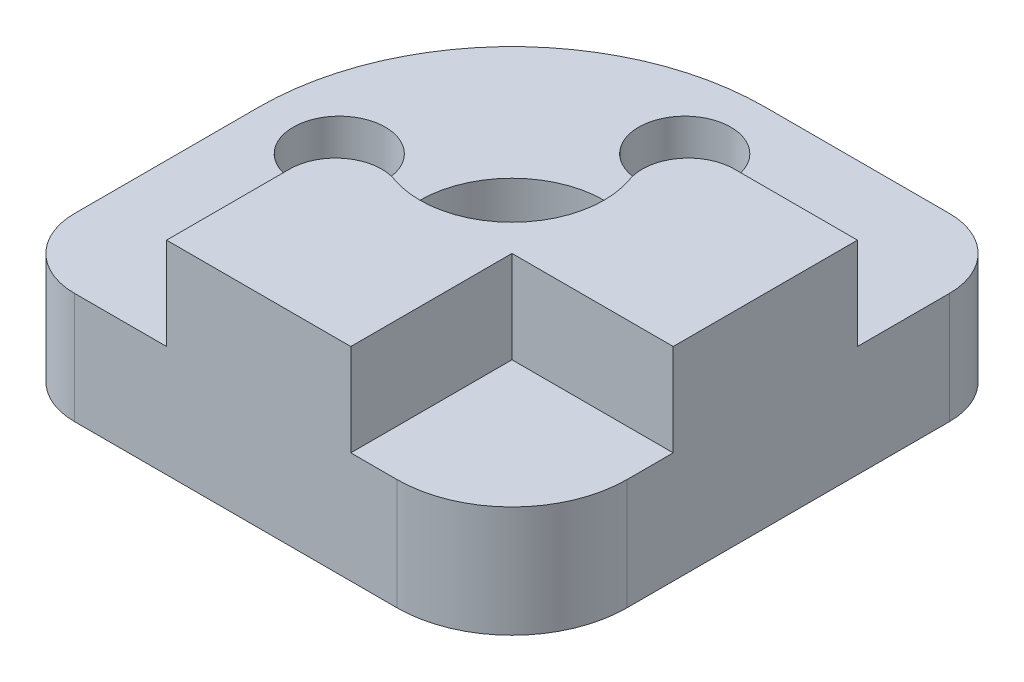
ISO-10303-21;
HEADER;
FILE_DESCRIPTION(('STEP AP214'),'2;1');
FILE_NAME('part.step','',(''),(''),'','','');
FILE_SCHEMA(('AUTOMOTIVE_DESIGN { 1 0 10303 214 1 1 1 1 }'));
ENDSEC;
DATA;
#1=APPLICATION_CONTEXT('core data for automotive mechanical design processes');
#2=APPLICATION_PROTOCOL_DEFINITION('international standard','automotive_design',2000,#1);
#3=PRODUCT_CONTEXT('',#1,'mechanical');
#4=PRODUCT('Part','Part','',(#3));
#5=PRODUCT_RELATED_PRODUCT_CATEGORY('part','',(#4));
#6=PRODUCT_DEFINITION_FORMATION('','',#4);
#7=PRODUCT_DEFINITION_CONTEXT('part definition',#1,'design');
#8=PRODUCT_DEFINITION('design','',#6,#7);
#9=PRODUCT_DEFINITION_SHAPE('','',#8);
#10=(LENGTH_UNIT() NAMED_UNIT(*) SI_UNIT(.MILLI.,.METRE.));
#11=(NAMED_UNIT(*) PLANE_ANGLE_UNIT() SI_UNIT($,.RADIAN.));
#12=(NAMED_UNIT(*) SI_UNIT($,.STERADIAN.) SOLID_ANGLE_UNIT());
#13=UNCERTAINTY_MEASURE_WITH_UNIT(LENGTH_MEASURE(1.E-05),#10,'distance_accuracy_value','');
#14=(GEOMETRIC_REPRESENTATION_CONTEXT(3) GLOBAL_UNCERTAINTY_ASSIGNED_CONTEXT((#13)) GLOBAL_UNIT_ASSIGNED_CONTEXT((#10,
#11,#12)) REPRESENTATION_CONTEXT('',''));
#15=CARTESIAN_POINT('',(0.,0.,0.));
#16=DIRECTION('',(0.,0.,1.));
#17=DIRECTION('',(1.,0.,0.));
#18=AXIS2_PLACEMENT_3D('',#15,#16,#17);
#19=CARTESIAN_POINT('',(0.,4.825,0.));
#20=DIRECTION('',(0.,1.,0.));
#21=DIRECTION('',(0.,0.,1.));
#22=AXIS2_PLACEMENT_3D('',#19,#20,#21);
#23=PLANE('',#22);
#24=DIRECTION('',(0.,0.,1.));
#25=VECTOR('',#24,1.);
#26=CARTESIAN_POINT('',(-4.,4.825,5.65685424949238));
#27=LINE('',#26,#25);
#28=CARTESIAN_POINT('',(-4.,4.825,5.65685424949238));
#29=VERTEX_POINT('',#28);
#30=CARTESIAN_POINT('',(-4.,4.825,11.));
#31=VERTEX_POINT('',#30);
#32=EDGE_CURVE('E50',#29,#31,#27,.T.);
#33=ORIENTED_EDGE('',*,*,#32,.F.);
#34=CARTESIAN_POINT('',(-2.,4.825,5.65685424949238));
#35=DIRECTION('',(0.,1.,0.));
#36=DIRECTION('',(0.,0.,1.));
#37=AXIS2_PLACEMENT_3D('',#34,#35,#36);
#38=CIRCLE('',#37,2.);
#39=CARTESIAN_POINT('',(-1.33333333333333,4.825,3.77123616632825));
#40=VERTEX_POINT('',#39);
#41=EDGE_CURVE('E193',#40,#29,#38,.T.);
#42=ORIENTED_EDGE('',*,*,#41,.F.);
#43=CARTESIAN_POINT('',(0.,4.825,0.));
#44=DIRECTION('',(0.,1.,0.));
#45=DIRECTION('',(0.,0.,1.));
#46=AXIS2_PLACEMENT_3D('',#43,#44,#45);
#47=CIRCLE('',#46,4.);
#48=CARTESIAN_POINT('',(3.77123616632825,4.825,-1.33333333333333));
#49=VERTEX_POINT('',#48);
#50=EDGE_CURVE('E221',#49,#40,#47,.T.);
#51=ORIENTED_EDGE('',*,*,#50,.F.);
#52=CARTESIAN_POINT('',(5.65685424949238,4.825,-2.));
#53=DIRECTION('',(0.,1.,0.));
#54=DIRECTION('',(0.,0.,-1.));
#55=AXIS2_PLACEMENT_3D('',#52,#53,#54);
#56=CIRCLE('',#55,2.);
#57=CARTESIAN_POINT('',(5.65685424949238,4.825,-4.));
#58=VERTEX_POINT('',#57);
#59=EDGE_CURVE('E57',#58,#49,#56,.T.);
#60=ORIENTED_EDGE('',*,*,#59,.F.);
#61=DIRECTION('',(-1.,0.,0.));
#62=VECTOR('',#61,1.);
#63=CARTESIAN_POINT('',(5.65685424949238,4.825,-4.));
#64=LINE('',#63,#62);
#65=CARTESIAN_POINT('',(11.,4.825,-4.));
#66=VERTEX_POINT('',#65);
#67=EDGE_CURVE('E310',#66,#58,#64,.T.);
#68=ORIENTED_EDGE('',*,*,#67,.F.);
#69=DIRECTION('',(0.,0.,-1.));
#70=VECTOR('',#69,1.);
#71=CARTESIAN_POINT('',(11.,4.825,6.));
#72=LINE('',#71,#70);
#73=CARTESIAN_POINT('',(11.,4.825,-7.99999999999998));
#74=VERTEX_POINT('',#73);
#75=EDGE_CURVE('E283',#66,#74,#72,.T.);
#76=ORIENTED_EDGE('',*,*,#75,.T.);
#77=CARTESIAN_POINT('',(8.,4.825,-8.));
#78=DIRECTION('',(0.,1.,0.));
#79=DIRECTION('',(0.,0.,1.));
#80=AXIS2_PLACEMENT_3D('',#77,#78,#79);
#81=CIRCLE('',#80,3.);
#82=CARTESIAN_POINT('',(7.99999999999998,4.825,-11.));
#83=VERTEX_POINT('',#82);
#84=EDGE_CURVE('E278',#74,#83,#81,.T.);
#85=ORIENTED_EDGE('',*,*,#84,.T.);
#86=DIRECTION('',(-1.,0.,0.));
#87=VECTOR('',#86,1.);
#88=CARTESIAN_POINT('',(0.,4.825,-11.));
#89=LINE('',#88,#87);
#90=CARTESIAN_POINT('',(0.,4.825,-11.));
#91=VERTEX_POINT('',#90);
#92=EDGE_CURVE('E260',#83,#91,#89,.T.);
#93=ORIENTED_EDGE('',*,*,#92,.T.);
#94=CARTESIAN_POINT('',(0.,4.825,0.));
#95=DIRECTION('',(0.,1.,0.));
#96=DIRECTION('',(0.,0.,1.));
#97=AXIS2_PLACEMENT_3D('',#94,#95,#96);
#98=CIRCLE('',#97,11.);
#99=CARTESIAN_POINT('',(-11.,4.825,0.));
#100=VERTEX_POINT('',#99);
#101=EDGE_CURVE('E222',#91,#100,#98,.T.);
#102=ORIENTED_EDGE('',*,*,#101,.T.);
#103=DIRECTION('',(0.,0.,1.));
#104=VECTOR('',#103,1.);
#105=CARTESIAN_POINT('',(-11.,4.825,0.));
#106=LINE('',#105,#104);
#107=CARTESIAN_POINT('',(-11.,4.825,7.99999999999998));
#108=VERTEX_POINT('',#107);
#109=EDGE_CURVE('E225',#100,#108,#106,.T.);
#110=ORIENTED_EDGE('',*,*,#109,.T.);
#111=CARTESIAN_POINT('',(-8.,4.825,8.));
#112=DIRECTION('',(0.,1.,0.));
#113=DIRECTION('',(0.,0.,-1.));
#114=AXIS2_PLACEMENT_3D('',#111,#112,#113);
#115=CIRCLE('',#114,3.);
#116=CARTESIAN_POINT('',(-7.99999999999998,4.825,11.));
#117=VERTEX_POINT('',#116);
#118=EDGE_CURVE('E228',#108,#117,#115,.T.);
#119=ORIENTED_EDGE('',*,*,#118,.T.);
#120=DIRECTION('',(1.,0.,0.));
#121=VECTOR('',#120,1.);
#122=CARTESIAN_POINT('',(6.,4.825,11.));
#123=LINE('',#122,#121);
#124=EDGE_CURVE('E238',#117,#31,#123,.T.);
#125=ORIENTED_EDGE('',*,*,#124,.T.);
#126=EDGE_LOOP('',(#33,#42,#51,#60,#68,#76,#85,#93,#102,#110,#119,#125));
#127=FACE_BOUND('',#126,.T.);
#128=CARTESIAN_POINT('',(0.,4.825,-7.5));
#129=DIRECTION('',(0.,1.,0.));
#130=DIRECTION('',(0.,0.,1.));
#131=AXIS2_PLACEMENT_3D('',#128,#129,#130);
#132=CIRCLE('',#131,2.);
#133=CARTESIAN_POINT('',(0.,4.825,-5.5));
#134=VERTEX_POINT('',#133);
#135=EDGE_CURVE('E181',#134,#134,#132,.T.);
#136=ORIENTED_EDGE('',*,*,#135,.F.);
#137=EDGE_LOOP('',(#136));
#138=FACE_BOUND('',#137,.T.);
#139=CARTESIAN_POINT('',(-7.5,4.825,0.));
#140=DIRECTION('',(0.,1.,0.));
#141=DIRECTION('',(0.,0.,1.));
#142=AXIS2_PLACEMENT_3D('',#139,#140,#141);
#143=CIRCLE('',#142,2.);
#144=CARTESIAN_POINT('',(-7.5,4.825,2.));
#145=VERTEX_POINT('',#144);
#146=EDGE_CURVE('E213',#145,#145,#143,.T.);
#147=ORIENTED_EDGE('',*,*,#146,.F.);
#148=EDGE_LOOP('',(#147));
#149=FACE_BOUND('',#148,.T.);
#150=ADVANCED_FACE('F33',(#127,#138,#149),#23,.T.);
#151=DIRECTION('',(1.,0.,0.));
#152=VECTOR('',#151,1.);
#153=CARTESIAN_POINT('',(4.,4.825,4.));
#154=LINE('',#153,#152);
#155=CARTESIAN_POINT('',(4.,4.825,4.));
#156=VERTEX_POINT('',#155);
#157=CARTESIAN_POINT('',(11.,4.825,4.));
#158=VERTEX_POINT('',#157);
#159=EDGE_CURVE('E308',#156,#158,#154,.T.);
#160=ORIENTED_EDGE('',*,*,#159,.F.);
#161=DIRECTION('',(0.,0.,-1.));
#162=VECTOR('',#161,1.);
#163=CARTESIAN_POINT('',(4.,4.825,11.));
#164=LINE('',#163,#162);
#165=CARTESIAN_POINT('',(4.,4.825,11.));
#166=VERTEX_POINT('',#165);
#167=EDGE_CURVE('E311',#166,#156,#164,.T.);
#168=ORIENTED_EDGE('',*,*,#167,.F.);
#169=CARTESIAN_POINT('',(6.,4.825,11.));
#170=VERTEX_POINT('',#169);
#171=EDGE_CURVE('E177',#166,#170,#123,.T.);
#172=ORIENTED_EDGE('',*,*,#171,.T.);
#173=CARTESIAN_POINT('',(6.,4.825,6.));
#174=DIRECTION('',(0.,1.,0.));
#175=DIRECTION('',(0.,0.,-1.));
#176=AXIS2_PLACEMENT_3D('',#173,#174,#175);
#177=CIRCLE('',#176,5.);
#178=CARTESIAN_POINT('',(11.,4.825,6.));
#179=VERTEX_POINT('',#178);
#180=EDGE_CURVE('E232',#170,#179,#177,.T.);
#181=ORIENTED_EDGE('',*,*,#180,.T.);
#182=EDGE_CURVE('E279',#179,#158,#72,.T.);
#183=ORIENTED_EDGE('',*,*,#182,.T.);
#184=EDGE_LOOP('',(#160,#168,#172,#181,#183));
#185=FACE_BOUND('',#184,.T.);
#186=ADVANCED_FACE('F292',(#185),#23,.T.);
#187=CARTESIAN_POINT('',(0.,0.,0.));
#188=DIRECTION('',(0.,1.,0.));
#189=DIRECTION('',(0.,0.,1.));
#190=AXIS2_PLACEMENT_3D('',#187,#188,#189);
#191=PLANE('',#190);
#192=CARTESIAN_POINT('',(-7.5,0.,0.));
#193=DIRECTION('',(0.,1.,0.));
#194=DIRECTION('',(0.,0.,1.));
#195=AXIS2_PLACEMENT_3D('',#192,#193,#194);
#196=CIRCLE('',#195,2.);
#197=CARTESIAN_POINT('',(-7.5,0.,2.));
#198=VERTEX_POINT('',#197);
#199=EDGE_CURVE('E211',#198,#198,#196,.T.);
#200=ORIENTED_EDGE('',*,*,#199,.T.);
#201=EDGE_LOOP('',(#200));
#202=FACE_BOUND('',#201,.T.);
#203=CARTESIAN_POINT('',(0.,0.,0.));
#204=DIRECTION('',(0.,1.,0.));
#205=DIRECTION('',(0.,0.,1.));
#206=AXIS2_PLACEMENT_3D('',#203,#204,#205);
#207=CIRCLE('',#206,11.);
#208=CARTESIAN_POINT('',(0.,0.,-11.));
#209=VERTEX_POINT('',#208);
#210=CARTESIAN_POINT('',(-11.,0.,0.));
#211=VERTEX_POINT('',#210);
#212=EDGE_CURVE('E274',#209,#211,#207,.T.);
#213=ORIENTED_EDGE('',*,*,#212,.F.);
#214=DIRECTION('',(-1.,0.,0.));
#215=VECTOR('',#214,1.);
#216=CARTESIAN_POINT('',(0.,0.,-11.));
#217=LINE('',#216,#215);
#218=CARTESIAN_POINT('',(7.99999999999998,0.,-11.));
#219=VERTEX_POINT('',#218);
#220=EDGE_CURVE('E226',#219,#209,#217,.T.);
#221=ORIENTED_EDGE('',*,*,#220,.F.);
#222=CARTESIAN_POINT('',(8.,0.,-8.));
#223=DIRECTION('',(0.,1.,0.));
#224=DIRECTION('',(0.,0.,1.));
#225=AXIS2_PLACEMENT_3D('',#222,#223,#224);
#226=CIRCLE('',#225,3.);
#227=CARTESIAN_POINT('',(11.,0.,-7.99999999999998));
#228=VERTEX_POINT('',#227);
#229=EDGE_CURVE('E262',#228,#219,#226,.T.);
#230=ORIENTED_EDGE('',*,*,#229,.F.);
#231=DIRECTION('',(0.,0.,-1.));
#232=VECTOR('',#231,1.);
#233=CARTESIAN_POINT('',(11.,0.,6.));
#234=LINE('',#233,#232);
#235=CARTESIAN_POINT('',(11.,0.,6.));
#236=VERTEX_POINT('',#235);
#237=EDGE_CURVE('E264',#236,#228,#234,.T.);
#238=ORIENTED_EDGE('',*,*,#237,.F.);
#239=CARTESIAN_POINT('',(6.,0.,6.));
#240=DIRECTION('',(0.,1.,0.));
#241=DIRECTION('',(0.,0.,-1.));
#242=AXIS2_PLACEMENT_3D('',#239,#240,#241);
#243=CIRCLE('',#242,5.);
#244=CARTESIAN_POINT('',(6.,0.,11.));
#245=VERTEX_POINT('',#244);
#246=EDGE_CURVE('E266',#245,#236,#243,.T.);
#247=ORIENTED_EDGE('',*,*,#246,.F.);
#248=DIRECTION('',(1.,0.,0.));
#249=VECTOR('',#248,1.);
#250=CARTESIAN_POINT('',(6.,0.,11.));
#251=LINE('',#250,#249);
#252=CARTESIAN_POINT('',(-7.99999999999998,0.,11.));
#253=VERTEX_POINT('',#252);
#254=EDGE_CURVE('E268',#253,#245,#251,.T.);
#255=ORIENTED_EDGE('',*,*,#254,.F.);
#256=CARTESIAN_POINT('',(-8.,0.,8.));
#257=DIRECTION('',(0.,1.,0.));
#258=DIRECTION('',(0.,0.,-1.));
#259=AXIS2_PLACEMENT_3D('',#256,#257,#258);
#260=CIRCLE('',#259,3.);
#261=CARTESIAN_POINT('',(-11.,0.,7.99999999999998));
#262=VERTEX_POINT('',#261);
#263=EDGE_CURVE('E270',#262,#253,#260,.T.);
#264=ORIENTED_EDGE('',*,*,#263,.F.);
#265=DIRECTION('',(0.,0.,1.));
#266=VECTOR('',#265,1.);
#267=CARTESIAN_POINT('',(-11.,0.,0.));
#268=LINE('',#267,#266);
#269=EDGE_CURVE('E272',#211,#262,#268,.T.);
#270=ORIENTED_EDGE('',*,*,#269,.F.);
#271=EDGE_LOOP('',(#213,#221,#230,#238,#247,#255,#264,#270));
#272=FACE_BOUND('',#271,.T.);
#273=CARTESIAN_POINT('',(0.,0.,0.));
#274=DIRECTION('',(0.,1.,0.));
#275=DIRECTION('',(0.,0.,1.));
#276=AXIS2_PLACEMENT_3D('',#273,#274,#275);
#277=CIRCLE('',#276,4.);
#278=CARTESIAN_POINT('',(0.,0.,4.));
#279=VERTEX_POINT('',#278);
#280=EDGE_CURVE('E216',#279,#279,#277,.T.);
#281=ORIENTED_EDGE('',*,*,#280,.T.);
#282=EDGE_LOOP('',(#281));
#283=FACE_BOUND('',#282,.T.);
#284=CARTESIAN_POINT('',(0.,0.,-7.5));
#285=DIRECTION('',(0.,1.,0.));
#286=DIRECTION('',(0.,0.,1.));
#287=AXIS2_PLACEMENT_3D('',#284,#285,#286);
#288=CIRCLE('',#287,2.);
#289=CARTESIAN_POINT('',(0.,0.,-5.5));
#290=VERTEX_POINT('',#289);
#291=EDGE_CURVE('E178',#290,#290,#288,.T.);
#292=ORIENTED_EDGE('',*,*,#291,.T.);
#293=EDGE_LOOP('',(#292));
#294=FACE_BOUND('',#293,.T.);
#295=ADVANCED_FACE('F374',(#202,#272,#283,#294),#191,.F.);
#296=CARTESIAN_POINT('',(0.,4.825,0.));
#297=DIRECTION('',(0.,-1.,0.));
#298=DIRECTION('',(0.,0.,-1.));
#299=AXIS2_PLACEMENT_3D('',#296,#297,#298);
#300=CYLINDRICAL_SURFACE('',#299,11.);
#301=ORIENTED_EDGE('',*,*,#212,.T.);
#302=DIRECTION('',(0.,-1.,0.));
#303=VECTOR('',#302,1.);
#304=CARTESIAN_POINT('',(-11.,4.825,0.));
#305=LINE('',#304,#303);
#306=EDGE_CURVE('E11',#100,#211,#305,.T.);
#307=ORIENTED_EDGE('',*,*,#306,.F.);
#308=ORIENTED_EDGE('',*,*,#101,.F.);
#309=DIRECTION('',(0.,-1.,0.));
#310=VECTOR('',#309,1.);
#311=CARTESIAN_POINT('',(0.,4.825,-11.));
#312=LINE('',#311,#310);
#313=EDGE_CURVE('E257',#91,#209,#312,.T.);
#314=ORIENTED_EDGE('',*,*,#313,.T.);
#315=EDGE_LOOP('',(#301,#307,#308,#314));
#316=FACE_BOUND('',#315,.T.);
#317=ADVANCED_FACE('F35',(#316),#300,.T.);
#318=CARTESIAN_POINT('',(-11.,4.825,0.));
#319=DIRECTION('',(1.,0.,0.));
#320=DIRECTION('',(0.,0.,-1.));
#321=AXIS2_PLACEMENT_3D('',#318,#319,#320);
#322=PLANE('',#321);
#323=ORIENTED_EDGE('',*,*,#269,.T.);
#324=DIRECTION('',(0.,-1.,0.));
#325=VECTOR('',#324,1.);
#326=CARTESIAN_POINT('',(-11.,4.825,7.99999999999998));
#327=LINE('',#326,#325);
#328=EDGE_CURVE('E42',#108,#262,#327,.T.);
#329=ORIENTED_EDGE('',*,*,#328,.F.);
#330=ORIENTED_EDGE('',*,*,#109,.F.);
#331=ORIENTED_EDGE('',*,*,#306,.T.);
#332=EDGE_LOOP('',(#323,#329,#330,#331));
#333=FACE_BOUND('',#332,.T.);
#334=ADVANCED_FACE('F390',(#333),#322,.F.);
#335=CARTESIAN_POINT('',(-8.,4.825,8.));
#336=DIRECTION('',(0.,-1.,0.));
#337=DIRECTION('',(0.,0.,-1.));
#338=AXIS2_PLACEMENT_3D('',#335,#336,#337);
#339=CYLINDRICAL_SURFACE('',#338,3.);
#340=ORIENTED_EDGE('',*,*,#263,.T.);
#341=DIRECTION('',(0.,-1.,0.));
#342=VECTOR('',#341,1.);
#343=CARTESIAN_POINT('',(-7.99999999999998,4.825,11.));
#344=LINE('',#343,#342);
#345=EDGE_CURVE('E242',#117,#253,#344,.T.);
#346=ORIENTED_EDGE('',*,*,#345,.F.);
#347=ORIENTED_EDGE('',*,*,#118,.F.);
#348=ORIENTED_EDGE('',*,*,#328,.T.);
#349=EDGE_LOOP('',(#340,#346,#347,#348));
#350=FACE_BOUND('',#349,.T.);
#351=ADVANCED_FACE('F370',(#350),#339,.T.);
#352=CARTESIAN_POINT('',(6.,4.825,11.));
#353=DIRECTION('',(0.,0.,-1.));
#354=DIRECTION('',(-1.,0.,0.));
#355=AXIS2_PLACEMENT_3D('',#352,#353,#354);
#356=PLANE('',#355);
#357=ORIENTED_EDGE('',*,*,#254,.T.);
#358=DIRECTION('',(0.,-1.,0.));
#359=VECTOR('',#358,1.);
#360=CARTESIAN_POINT('',(6.,4.825,11.));
#361=LINE('',#360,#359);
#362=EDGE_CURVE('E245',#170,#245,#361,.T.);
#363=ORIENTED_EDGE('',*,*,#362,.F.);
#364=ORIENTED_EDGE('',*,*,#171,.F.);
#365=DIRECTION('',(0.,-1.,0.));
#366=VECTOR('',#365,1.);
#367=CARTESIAN_POINT('',(4.,8.825,11.));
#368=LINE('',#367,#366);
#369=CARTESIAN_POINT('',(4.,8.825,11.));
#370=VERTEX_POINT('',#369);
#371=EDGE_CURVE('E158',#370,#166,#368,.T.);
#372=ORIENTED_EDGE('',*,*,#371,.F.);
#373=DIRECTION('',(1.,0.,0.));
#374=VECTOR('',#373,1.);
#375=CARTESIAN_POINT('',(-4.,8.825,11.));
#376=LINE('',#375,#374);
#377=CARTESIAN_POINT('',(-4.,8.825,11.));
#378=VERTEX_POINT('',#377);
#379=EDGE_CURVE('E164',#378,#370,#376,.T.);
#380=ORIENTED_EDGE('',*,*,#379,.F.);
#381=DIRECTION('',(0.,-1.,0.));
#382=VECTOR('',#381,1.);
#383=CARTESIAN_POINT('',(-4.,8.825,11.));
#384=LINE('',#383,#382);
#385=EDGE_CURVE('E194',#378,#31,#384,.T.);
#386=ORIENTED_EDGE('',*,*,#385,.T.);
#387=ORIENTED_EDGE('',*,*,#124,.F.);
#388=ORIENTED_EDGE('',*,*,#345,.T.);
#389=EDGE_LOOP('',(#357,#363,#364,#372,#380,#386,#387,#388));
#390=FACE_BOUND('',#389,.T.);
#391=ADVANCED_FACE('F175',(#390),#356,.F.);
#392=CARTESIAN_POINT('',(6.,4.825,6.));
#393=DIRECTION('',(0.,-1.,0.));
#394=DIRECTION('',(0.,0.,-1.));
#395=AXIS2_PLACEMENT_3D('',#392,#393,#394);
#396=CYLINDRICAL_SURFACE('',#395,5.);
#397=ORIENTED_EDGE('',*,*,#246,.T.);
#398=DIRECTION('',(0.,-1.,0.));
#399=VECTOR('',#398,1.);
#400=CARTESIAN_POINT('',(11.,4.825,6.));
#401=LINE('',#400,#399);
#402=EDGE_CURVE('E248',#179,#236,#401,.T.);
#403=ORIENTED_EDGE('',*,*,#402,.F.);
#404=ORIENTED_EDGE('',*,*,#180,.F.);
#405=ORIENTED_EDGE('',*,*,#362,.T.);
#406=EDGE_LOOP('',(#397,#403,#404,#405));
#407=FACE_BOUND('',#406,.T.);
#408=ADVANCED_FACE('F294',(#407),#396,.T.);
#409=CARTESIAN_POINT('',(11.,4.825,6.));
#410=DIRECTION('',(-1.,0.,0.));
#411=DIRECTION('',(0.,0.,1.));
#412=AXIS2_PLACEMENT_3D('',#409,#410,#411);
#413=PLANE('',#412);
#414=ORIENTED_EDGE('',*,*,#237,.T.);
#415=DIRECTION('',(0.,-1.,0.));
#416=VECTOR('',#415,1.);
#417=CARTESIAN_POINT('',(11.,4.825,-7.99999999999998));
#418=LINE('',#417,#416);
#419=EDGE_CURVE('E251',#74,#228,#418,.T.);
#420=ORIENTED_EDGE('',*,*,#419,.F.);
#421=ORIENTED_EDGE('',*,*,#75,.F.);
#422=DIRECTION('',(0.,-1.,0.));
#423=VECTOR('',#422,1.);
#424=CARTESIAN_POINT('',(11.,8.825,-4.));
#425=LINE('',#424,#423);
#426=CARTESIAN_POINT('',(11.,8.825,-4.));
#427=VERTEX_POINT('',#426);
#428=EDGE_CURVE('E207',#427,#66,#425,.T.);
#429=ORIENTED_EDGE('',*,*,#428,.F.);
#430=DIRECTION('',(0.,0.,-1.));
#431=VECTOR('',#430,1.);
#432=CARTESIAN_POINT('',(11.,8.825,4.));
#433=LINE('',#432,#431);
#434=CARTESIAN_POINT('',(11.,8.825,4.));
#435=VERTEX_POINT('',#434);
#436=EDGE_CURVE('E303',#435,#427,#433,.T.);
#437=ORIENTED_EDGE('',*,*,#436,.F.);
#438=DIRECTION('',(0.,-1.,0.));
#439=VECTOR('',#438,1.);
#440=CARTESIAN_POINT('',(11.,8.825,4.));
#441=LINE('',#440,#439);
#442=EDGE_CURVE('E183',#435,#158,#441,.T.);
#443=ORIENTED_EDGE('',*,*,#442,.T.);
#444=ORIENTED_EDGE('',*,*,#182,.F.);
#445=ORIENTED_EDGE('',*,*,#402,.T.);
#446=EDGE_LOOP('',(#414,#420,#421,#429,#437,#443,#444,#445));
#447=FACE_BOUND('',#446,.T.);
#448=ADVANCED_FACE('F299',(#447),#413,.F.);
#449=CARTESIAN_POINT('',(8.,4.825,-8.));
#450=DIRECTION('',(0.,-1.,0.));
#451=DIRECTION('',(0.,0.,-1.));
#452=AXIS2_PLACEMENT_3D('',#449,#450,#451);
#453=CYLINDRICAL_SURFACE('',#452,3.);
#454=ORIENTED_EDGE('',*,*,#229,.T.);
#455=DIRECTION('',(0.,-1.,0.));
#456=VECTOR('',#455,1.);
#457=CARTESIAN_POINT('',(7.99999999999998,4.825,-11.));
#458=LINE('',#457,#456);
#459=EDGE_CURVE('E254',#83,#219,#458,.T.);
#460=ORIENTED_EDGE('',*,*,#459,.F.);
#461=ORIENTED_EDGE('',*,*,#84,.F.);
#462=ORIENTED_EDGE('',*,*,#419,.T.);
#463=EDGE_LOOP('',(#454,#460,#461,#462));
#464=FACE_BOUND('',#463,.T.);
#465=ADVANCED_FACE('F380',(#464),#453,.T.);
#466=CARTESIAN_POINT('',(0.,4.825,-11.));
#467=DIRECTION('',(0.,0.,1.));
#468=DIRECTION('',(1.,0.,0.));
#469=AXIS2_PLACEMENT_3D('',#466,#467,#468);
#470=PLANE('',#469);
#471=ORIENTED_EDGE('',*,*,#220,.T.);
#472=ORIENTED_EDGE('',*,*,#313,.F.);
#473=ORIENTED_EDGE('',*,*,#92,.F.);
#474=ORIENTED_EDGE('',*,*,#459,.T.);
#475=EDGE_LOOP('',(#471,#472,#473,#474));
#476=FACE_BOUND('',#475,.T.);
#477=ADVANCED_FACE('F387',(#476),#470,.F.);
#478=CARTESIAN_POINT('',(0.,4.825,0.));
#479=DIRECTION('',(0.,-1.,0.));
#480=DIRECTION('',(0.,0.,-1.));
#481=AXIS2_PLACEMENT_3D('',#478,#479,#480);
#482=CYLINDRICAL_SURFACE('',#481,4.);
#483=ORIENTED_EDGE('',*,*,#50,.T.);
#484=DIRECTION('',(0.,-1.,0.));
#485=VECTOR('',#484,1.);
#486=CARTESIAN_POINT('',(-1.33333333333333,8.825,3.77123616632825));
#487=LINE('',#486,#485);
#488=CARTESIAN_POINT('',(-1.33333333333333,8.825,3.77123616632825));
#489=VERTEX_POINT('',#488);
#490=EDGE_CURVE('E204',#489,#40,#487,.T.);
#491=ORIENTED_EDGE('',*,*,#490,.F.);
#492=CARTESIAN_POINT('',(0.,8.825,0.));
#493=DIRECTION('',(0.,-1.,0.));
#494=DIRECTION('',(0.,0.,1.));
#495=AXIS2_PLACEMENT_3D('',#492,#493,#494);
#496=CIRCLE('',#495,4.);
#497=CARTESIAN_POINT('',(3.77123616632825,8.825,-1.33333333333334));
#498=VERTEX_POINT('',#497);
#499=EDGE_CURVE('E318',#498,#489,#496,.T.);
#500=ORIENTED_EDGE('',*,*,#499,.F.);
#501=DIRECTION('',(0.,-1.,0.));
#502=VECTOR('',#501,1.);
#503=CARTESIAN_POINT('',(3.77123616632825,8.825,-1.33333333333334));
#504=LINE('',#503,#502);
#505=EDGE_CURVE('E208',#498,#49,#504,.T.);
#506=ORIENTED_EDGE('',*,*,#505,.T.);
#507=EDGE_LOOP('',(#483,#491,#500,#506));
#508=FACE_BOUND('',#507,.T.);
#509=ORIENTED_EDGE('',*,*,#280,.F.);
#510=EDGE_LOOP('',(#509));
#511=FACE_BOUND('',#510,.T.);
#512=ADVANCED_FACE('F333',(#508,#511),#482,.F.);
#513=CARTESIAN_POINT('',(-7.5,4.825,0.));
#514=DIRECTION('',(0.,-1.,0.));
#515=DIRECTION('',(0.,0.,-1.));
#516=AXIS2_PLACEMENT_3D('',#513,#514,#515);
#517=CYLINDRICAL_SURFACE('',#516,2.);
#518=ORIENTED_EDGE('',*,*,#146,.T.);
#519=EDGE_LOOP('',(#518));
#520=FACE_BOUND('',#519,.T.);
#521=ORIENTED_EDGE('',*,*,#199,.F.);
#522=EDGE_LOOP('',(#521));
#523=FACE_BOUND('',#522,.T.);
#524=ADVANCED_FACE('F445',(#520,#523),#517,.F.);
#525=CARTESIAN_POINT('',(0.,4.825,-7.5));
#526=DIRECTION('',(0.,-1.,0.));
#527=DIRECTION('',(0.,0.,-1.));
#528=AXIS2_PLACEMENT_3D('',#525,#526,#527);
#529=CYLINDRICAL_SURFACE('',#528,2.);
#530=ORIENTED_EDGE('',*,*,#135,.T.);
#531=EDGE_LOOP('',(#530));
#532=FACE_BOUND('',#531,.T.);
#533=ORIENTED_EDGE('',*,*,#291,.F.);
#534=EDGE_LOOP('',(#533));
#535=FACE_BOUND('',#534,.T.);
#536=ADVANCED_FACE('F451',(#532,#535),#529,.F.);
#537=CARTESIAN_POINT('',(4.,8.825,11.));
#538=DIRECTION('',(-1.,0.,0.));
#539=DIRECTION('',(0.,0.,1.));
#540=AXIS2_PLACEMENT_3D('',#537,#538,#539);
#541=PLANE('',#540);
#542=ORIENTED_EDGE('',*,*,#167,.T.);
#543=DIRECTION('',(0.,-1.,0.));
#544=VECTOR('',#543,1.);
#545=CARTESIAN_POINT('',(4.,8.825,4.));
#546=LINE('',#545,#544);
#547=CARTESIAN_POINT('',(4.,8.825,4.));
#548=VERTEX_POINT('',#547);
#549=EDGE_CURVE('E160',#548,#156,#546,.T.);
#550=ORIENTED_EDGE('',*,*,#549,.F.);
#551=DIRECTION('',(0.,0.,-1.));
#552=VECTOR('',#551,1.);
#553=CARTESIAN_POINT('',(4.,8.825,11.));
#554=LINE('',#553,#552);
#555=EDGE_CURVE('E153',#370,#548,#554,.T.);
#556=ORIENTED_EDGE('',*,*,#555,.F.);
#557=ORIENTED_EDGE('',*,*,#371,.T.);
#558=EDGE_LOOP('',(#542,#550,#556,#557));
#559=FACE_BOUND('',#558,.T.);
#560=ADVANCED_FACE('F156',(#559),#541,.F.);
#561=CARTESIAN_POINT('',(4.,8.825,4.));
#562=DIRECTION('',(0.,0.,-1.));
#563=DIRECTION('',(-1.,0.,0.));
#564=AXIS2_PLACEMENT_3D('',#561,#562,#563);
#565=PLANE('',#564);
#566=ORIENTED_EDGE('',*,*,#159,.T.);
#567=ORIENTED_EDGE('',*,*,#442,.F.);
#568=DIRECTION('',(1.,0.,0.));
#569=VECTOR('',#568,1.);
#570=CARTESIAN_POINT('',(4.,8.825,4.));
#571=LINE('',#570,#569);
#572=EDGE_CURVE('E163',#548,#435,#571,.T.);
#573=ORIENTED_EDGE('',*,*,#572,.F.);
#574=ORIENTED_EDGE('',*,*,#549,.T.);
#575=EDGE_LOOP('',(#566,#567,#573,#574));
#576=FACE_BOUND('',#575,.T.);
#577=ADVANCED_FACE('F325',(#576),#565,.F.);
#578=CARTESIAN_POINT('',(5.65685424949238,8.825,-4.));
#579=DIRECTION('',(0.,0.,1.));
#580=DIRECTION('',(1.,0.,0.));
#581=AXIS2_PLACEMENT_3D('',#578,#579,#580);
#582=PLANE('',#581);
#583=ORIENTED_EDGE('',*,*,#67,.T.);
#584=DIRECTION('',(0.,-1.,0.));
#585=VECTOR('',#584,1.);
#586=CARTESIAN_POINT('',(5.65685424949238,8.825,-4.));
#587=LINE('',#586,#585);
#588=CARTESIAN_POINT('',(5.65685424949238,8.825,-4.));
#589=VERTEX_POINT('',#588);
#590=EDGE_CURVE('E205',#589,#58,#587,.T.);
#591=ORIENTED_EDGE('',*,*,#590,.F.);
#592=DIRECTION('',(-1.,0.,0.));
#593=VECTOR('',#592,1.);
#594=CARTESIAN_POINT('',(5.65685424949238,8.825,-4.));
#595=LINE('',#594,#593);
#596=EDGE_CURVE('E322',#427,#589,#595,.T.);
#597=ORIENTED_EDGE('',*,*,#596,.F.);
#598=ORIENTED_EDGE('',*,*,#428,.T.);
#599=EDGE_LOOP('',(#583,#591,#597,#598));
#600=FACE_BOUND('',#599,.T.);
#601=ADVANCED_FACE('F356',(#600),#582,.F.);
#602=CARTESIAN_POINT('',(5.65685424949238,8.825,-2.));
#603=DIRECTION('',(0.,-1.,0.));
#604=DIRECTION('',(0.,0.,-1.));
#605=AXIS2_PLACEMENT_3D('',#602,#603,#604);
#606=CYLINDRICAL_SURFACE('',#605,2.);
#607=ORIENTED_EDGE('',*,*,#59,.T.);
#608=ORIENTED_EDGE('',*,*,#505,.F.);
#609=CARTESIAN_POINT('',(5.65685424949238,8.825,-2.));
#610=DIRECTION('',(0.,1.,0.));
#611=DIRECTION('',(0.,0.,-1.));
#612=AXIS2_PLACEMENT_3D('',#609,#610,#611);
#613=CIRCLE('',#612,2.);
#614=EDGE_CURVE('E320',#589,#498,#613,.T.);
#615=ORIENTED_EDGE('',*,*,#614,.F.);
#616=ORIENTED_EDGE('',*,*,#590,.T.);
#617=EDGE_LOOP('',(#607,#608,#615,#616));
#618=FACE_BOUND('',#617,.T.);
#619=ADVANCED_FACE('F360',(#618),#606,.T.);
#620=CARTESIAN_POINT('',(-2.,8.825,5.65685424949238));
#621=DIRECTION('',(0.,-1.,0.));
#622=DIRECTION('',(0.,0.,-1.));
#623=AXIS2_PLACEMENT_3D('',#620,#621,#622);
#624=CYLINDRICAL_SURFACE('',#623,2.);
#625=ORIENTED_EDGE('',*,*,#41,.T.);
#626=DIRECTION('',(0.,-1.,0.));
#627=VECTOR('',#626,1.);
#628=CARTESIAN_POINT('',(-4.,8.825,5.65685424949238));
#629=LINE('',#628,#627);
#630=CARTESIAN_POINT('',(-4.,8.825,5.65685424949238));
#631=VERTEX_POINT('',#630);
#632=EDGE_CURVE('E201',#631,#29,#629,.T.);
#633=ORIENTED_EDGE('',*,*,#632,.F.);
#634=CARTESIAN_POINT('',(-2.,8.825,5.65685424949238));
#635=DIRECTION('',(0.,1.,0.));
#636=DIRECTION('',(0.,0.,1.));
#637=AXIS2_PLACEMENT_3D('',#634,#635,#636);
#638=CIRCLE('',#637,2.);
#639=EDGE_CURVE('E316',#489,#631,#638,.T.);
#640=ORIENTED_EDGE('',*,*,#639,.F.);
#641=ORIENTED_EDGE('',*,*,#490,.T.);
#642=EDGE_LOOP('',(#625,#633,#640,#641));
#643=FACE_BOUND('',#642,.T.);
#644=ADVANCED_FACE('F339',(#643),#624,.T.);
#645=CARTESIAN_POINT('',(-4.,8.825,5.65685424949238));
#646=DIRECTION('',(1.,0.,0.));
#647=DIRECTION('',(0.,0.,-1.));
#648=AXIS2_PLACEMENT_3D('',#645,#646,#647);
#649=PLANE('',#648);
#650=ORIENTED_EDGE('',*,*,#32,.T.);
#651=ORIENTED_EDGE('',*,*,#385,.F.);
#652=DIRECTION('',(0.,0.,1.));
#653=VECTOR('',#652,1.);
#654=CARTESIAN_POINT('',(-4.,8.825,5.65685424949238));
#655=LINE('',#654,#653);
#656=EDGE_CURVE('E169',#631,#378,#655,.T.);
#657=ORIENTED_EDGE('',*,*,#656,.F.);
#658=ORIENTED_EDGE('',*,*,#632,.T.);
#659=EDGE_LOOP('',(#650,#651,#657,#658));
#660=FACE_BOUND('',#659,.T.);
#661=ADVANCED_FACE('F362',(#660),#649,.F.);
#662=CARTESIAN_POINT('',(5.65685424949238,8.825,-2.));
#663=DIRECTION('',(0.,-1.,0.));
#664=DIRECTION('',(0.,0.,-1.));
#665=AXIS2_PLACEMENT_3D('',#662,#663,#664);
#666=PLANE('',#665);
#667=ORIENTED_EDGE('',*,*,#379,.T.);
#668=ORIENTED_EDGE('',*,*,#555,.T.);
#669=ORIENTED_EDGE('',*,*,#572,.T.);
#670=ORIENTED_EDGE('',*,*,#436,.T.);
#671=ORIENTED_EDGE('',*,*,#596,.T.);
#672=ORIENTED_EDGE('',*,*,#614,.T.);
#673=ORIENTED_EDGE('',*,*,#499,.T.);
#674=ORIENTED_EDGE('',*,*,#639,.T.);
#675=ORIENTED_EDGE('',*,*,#656,.T.);
#676=EDGE_LOOP('',(#667,#668,#669,#670,#671,#672,#673,#674,#675));
#677=FACE_BOUND('',#676,.T.);
#678=ADVANCED_FACE('F167',(#677),#666,.F.);
#679=CLOSED_SHELL('',(#150,#186,#295,#317,#334,#351,#391,#408,#448,#465,#477,#512,#524,#536,
#560,#577,#601,#619,#644,#661,#678));
#680=MANIFOLD_SOLID_BREP('B2',#679);
#681=ADVANCED_BREP_SHAPE_REPRESENTATION('',(#18,#680),#14);
#682=SHAPE_DEFINITION_REPRESENTATION(#9,#681);
ENDSEC;
END-ISO-10303-21;
